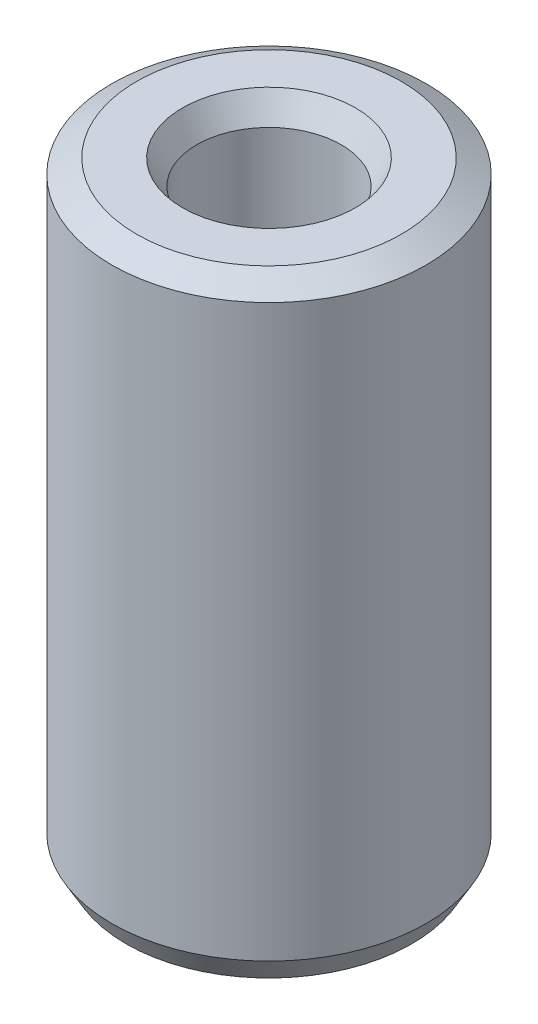
ISO-10303-21;
HEADER;
FILE_DESCRIPTION(('STEP AP214'),'2;1');
FILE_NAME('part.step','',(''),(''),'','','');
FILE_SCHEMA(('AUTOMOTIVE_DESIGN { 1 0 10303 214 1 1 1 1 }'));
ENDSEC;
DATA;
#1=APPLICATION_CONTEXT('core data for automotive mechanical design processes');
#2=APPLICATION_PROTOCOL_DEFINITION('international standard','automotive_design',2000,#1);
#3=PRODUCT_CONTEXT('',#1,'mechanical');
#4=PRODUCT('Part','Part','',(#3));
#5=PRODUCT_RELATED_PRODUCT_CATEGORY('part','',(#4));
#6=PRODUCT_DEFINITION_FORMATION('','',#4);
#7=PRODUCT_DEFINITION_CONTEXT('part definition',#1,'design');
#8=PRODUCT_DEFINITION('design','',#6,#7);
#9=PRODUCT_DEFINITION_SHAPE('','',#8);
#10=(LENGTH_UNIT() NAMED_UNIT(*) SI_UNIT(.MILLI.,.METRE.));
#11=(NAMED_UNIT(*) PLANE_ANGLE_UNIT() SI_UNIT($,.RADIAN.));
#12=(NAMED_UNIT(*) SI_UNIT($,.STERADIAN.) SOLID_ANGLE_UNIT());
#13=UNCERTAINTY_MEASURE_WITH_UNIT(LENGTH_MEASURE(1.E-05),#10,'distance_accuracy_value','');
#14=(GEOMETRIC_REPRESENTATION_CONTEXT(3) GLOBAL_UNCERTAINTY_ASSIGNED_CONTEXT((#13)) GLOBAL_UNIT_ASSIGNED_CONTEXT((#10,
#11,#12)) REPRESENTATION_CONTEXT('',''));
#15=CARTESIAN_POINT('',(0.,0.,0.));
#16=DIRECTION('',(0.,0.,1.));
#17=DIRECTION('',(1.,0.,0.));
#18=AXIS2_PLACEMENT_3D('',#15,#16,#17);
#19=CARTESIAN_POINT('',(0.,135.710383681747,0.));
#20=DIRECTION('',(0.,-1.,0.));
#21=DIRECTION('',(0.,0.,-1.));
#22=AXIS2_PLACEMENT_3D('',#19,#20,#21);
#23=CYLINDRICAL_SURFACE('',#22,35.);
#24=CARTESIAN_POINT('',(0.,5.51253615393649,0.));
#25=DIRECTION('',(0.,1.,0.));
#26=DIRECTION('',(0.,0.,1.));
#27=AXIS2_PLACEMENT_3D('',#24,#25,#26);
#28=CIRCLE('',#27,35.);
#29=CARTESIAN_POINT('',(0.,5.51253615393649,35.));
#30=VERTEX_POINT('',#29);
#31=EDGE_CURVE('E10',#30,#30,#28,.T.);
#32=ORIENTED_EDGE('',*,*,#31,.T.);
#33=EDGE_LOOP('',(#32));
#34=FACE_BOUND('',#33,.T.);
#35=CARTESIAN_POINT('',(0.,132.527719449355,0.));
#36=DIRECTION('',(0.,1.,0.));
#37=DIRECTION('',(0.,0.,1.));
#38=AXIS2_PLACEMENT_3D('',#35,#36,#37);
#39=CIRCLE('',#38,35.);
#40=CARTESIAN_POINT('',(0.,132.527719449355,35.));
#41=VERTEX_POINT('',#40);
#42=EDGE_CURVE('E50',#41,#41,#39,.F.);
#43=ORIENTED_EDGE('',*,*,#42,.T.);
#44=EDGE_LOOP('',(#43));
#45=FACE_BOUND('',#44,.T.);
#46=ADVANCED_FACE('F39',(#34,#45),#23,.T.);
#47=CARTESIAN_POINT('',(0.,135.710383681747,0.));
#48=DIRECTION('',(0.,1.,0.));
#49=DIRECTION('',(0.,0.,1.));
#50=AXIS2_PLACEMENT_3D('',#47,#48,#49);
#51=PLANE('',#50);
#52=CARTESIAN_POINT('',(0.,135.710383681747,0.));
#53=DIRECTION('',(0.,1.,0.));
#54=DIRECTION('',(0.,0.,1.));
#55=AXIS2_PLACEMENT_3D('',#52,#53,#54);
#56=CIRCLE('',#55,19.2740611021097);
#57=CARTESIAN_POINT('',(0.,135.710383681747,19.2740611021097));
#58=VERTEX_POINT('',#57);
#59=EDGE_CURVE('E58',#58,#58,#56,.F.);
#60=ORIENTED_EDGE('',*,*,#59,.T.);
#61=EDGE_LOOP('',(#60));
#62=FACE_BOUND('',#61,.T.);
#63=CARTESIAN_POINT('',(0.,135.710383681747,0.));
#64=DIRECTION('',(0.,1.,0.));
#65=DIRECTION('',(0.,0.,1.));
#66=AXIS2_PLACEMENT_3D('',#63,#64,#65);
#67=CIRCLE('',#66,29.4874638460636);
#68=CARTESIAN_POINT('',(0.,135.710383681747,29.4874638460636));
#69=VERTEX_POINT('',#68);
#70=EDGE_CURVE('E61',#69,#69,#67,.T.);
#71=ORIENTED_EDGE('',*,*,#70,.T.);
#72=EDGE_LOOP('',(#71));
#73=FACE_BOUND('',#72,.T.);
#74=ADVANCED_FACE('F88',(#62,#73),#51,.T.);
#75=CARTESIAN_POINT('',(0.,0.,0.));
#76=DIRECTION('',(0.,1.,0.));
#77=DIRECTION('',(0.,0.,1.));
#78=AXIS2_PLACEMENT_3D('',#75,#76,#77);
#79=PLANE('',#78);
#80=CARTESIAN_POINT('',(0.,0.,0.));
#81=DIRECTION('',(0.,1.,0.));
#82=DIRECTION('',(0.,0.,1.));
#83=AXIS2_PLACEMENT_3D('',#80,#81,#82);
#84=CIRCLE('',#83,21.6039330236534);
#85=CARTESIAN_POINT('',(0.,0.,21.6039330236534));
#86=VERTEX_POINT('',#85);
#87=EDGE_CURVE('E51',#86,#86,#84,.T.);
#88=ORIENTED_EDGE('',*,*,#87,.T.);
#89=EDGE_LOOP('',(#88));
#90=FACE_BOUND('',#89,.T.);
#91=CARTESIAN_POINT('',(0.,0.,0.));
#92=DIRECTION('',(0.,1.,0.));
#93=DIRECTION('',(0.,0.,1.));
#94=AXIS2_PLACEMENT_3D('',#91,#92,#93);
#95=CIRCLE('',#94,31.8173357676072);
#96=CARTESIAN_POINT('',(0.,0.,31.8173357676072));
#97=VERTEX_POINT('',#96);
#98=EDGE_CURVE('E54',#97,#97,#95,.F.);
#99=ORIENTED_EDGE('',*,*,#98,.T.);
#100=EDGE_LOOP('',(#99));
#101=FACE_BOUND('',#100,.T.);
#102=ADVANCED_FACE('F83',(#90,#101),#79,.F.);
#103=CARTESIAN_POINT('',(0.,135.710383681747,0.));
#104=DIRECTION('',(0.,-1.,0.));
#105=DIRECTION('',(0.,0.,-1.));
#106=AXIS2_PLACEMENT_3D('',#103,#104,#105);
#107=CYLINDRICAL_SURFACE('',#106,16.0913968697169);
#108=CARTESIAN_POINT('',(0.,130.197847527811,0.));
#109=DIRECTION('',(0.,1.,0.));
#110=DIRECTION('',(0.,0.,1.));
#111=AXIS2_PLACEMENT_3D('',#108,#109,#110);
#112=CIRCLE('',#111,16.0913968697169);
#113=CARTESIAN_POINT('',(0.,130.197847527811,16.0913968697169));
#114=VERTEX_POINT('',#113);
#115=EDGE_CURVE('E67',#114,#114,#112,.T.);
#116=ORIENTED_EDGE('',*,*,#115,.T.);
#117=EDGE_LOOP('',(#116));
#118=FACE_BOUND('',#117,.T.);
#119=CARTESIAN_POINT('',(0.,3.18266423239277,0.));
#120=DIRECTION('',(0.,1.,0.));
#121=DIRECTION('',(0.,0.,1.));
#122=AXIS2_PLACEMENT_3D('',#119,#120,#121);
#123=CIRCLE('',#122,16.0913968697169);
#124=CARTESIAN_POINT('',(0.,3.18266423239277,16.0913968697169));
#125=VERTEX_POINT('',#124);
#126=EDGE_CURVE('E69',#125,#125,#123,.F.);
#127=ORIENTED_EDGE('',*,*,#126,.T.);
#128=EDGE_LOOP('',(#127));
#129=FACE_BOUND('',#128,.T.);
#130=ADVANCED_FACE('F71',(#118,#129),#107,.F.);
#131=CARTESIAN_POINT('',(0.,130.197847527811,0.));
#132=DIRECTION('',(0.,1.,0.));
#133=DIRECTION('',(0.,0.,1.));
#134=AXIS2_PLACEMENT_3D('',#131,#132,#133);
#135=CONICAL_SURFACE('',#134,16.0913968697169,0.523598775598301);
#136=ORIENTED_EDGE('',*,*,#59,.F.);
#137=EDGE_LOOP('',(#136));
#138=FACE_BOUND('',#137,.T.);
#139=ORIENTED_EDGE('',*,*,#115,.F.);
#140=EDGE_LOOP('',(#139));
#141=FACE_BOUND('',#140,.T.);
#142=ADVANCED_FACE('F77',(#138,#141),#135,.F.);
#143=CARTESIAN_POINT('',(0.,0.,0.));
#144=DIRECTION('',(0.,-1.,0.));
#145=DIRECTION('',(0.,0.,-1.));
#146=AXIS2_PLACEMENT_3D('',#143,#144,#145);
#147=CONICAL_SURFACE('',#146,21.6039330236534,1.04719755119659);
#148=ORIENTED_EDGE('',*,*,#126,.F.);
#149=EDGE_LOOP('',(#148));
#150=FACE_BOUND('',#149,.T.);
#151=ORIENTED_EDGE('',*,*,#87,.F.);
#152=EDGE_LOOP('',(#151));
#153=FACE_BOUND('',#152,.T.);
#154=ADVANCED_FACE('F73',(#150,#153),#147,.F.);
#155=CARTESIAN_POINT('',(0.,5.51253615393649,0.));
#156=DIRECTION('',(0.,1.,0.));
#157=DIRECTION('',(0.,0.,1.));
#158=AXIS2_PLACEMENT_3D('',#155,#156,#157);
#159=CONICAL_SURFACE('',#158,35.,0.523598775598301);
#160=ORIENTED_EDGE('',*,*,#98,.F.);
#161=EDGE_LOOP('',(#160));
#162=FACE_BOUND('',#161,.T.);
#163=ORIENTED_EDGE('',*,*,#31,.F.);
#164=EDGE_LOOP('',(#163));
#165=FACE_BOUND('',#164,.T.);
#166=ADVANCED_FACE('F76',(#162,#165),#159,.T.);
#167=CARTESIAN_POINT('',(0.,135.710383681747,0.));
#168=DIRECTION('',(0.,-1.,0.));
#169=DIRECTION('',(0.,0.,-1.));
#170=AXIS2_PLACEMENT_3D('',#167,#168,#169);
#171=CONICAL_SURFACE('',#170,29.4874638460636,1.04719755119659);
#172=ORIENTED_EDGE('',*,*,#42,.F.);
#173=EDGE_LOOP('',(#172));
#174=FACE_BOUND('',#173,.T.);
#175=ORIENTED_EDGE('',*,*,#70,.F.);
#176=EDGE_LOOP('',(#175));
#177=FACE_BOUND('',#176,.T.);
#178=ADVANCED_FACE('F45',(#174,#177),#171,.T.);
#179=CLOSED_SHELL('',(#46,#74,#102,#130,#142,#154,#166,#178));
#180=MANIFOLD_SOLID_BREP('B2',#179);
#181=ADVANCED_BREP_SHAPE_REPRESENTATION('',(#18,#180),#14);
#182=SHAPE_DEFINITION_REPRESENTATION(#9,#181);
ENDSEC;
END-ISO-10303-21;
